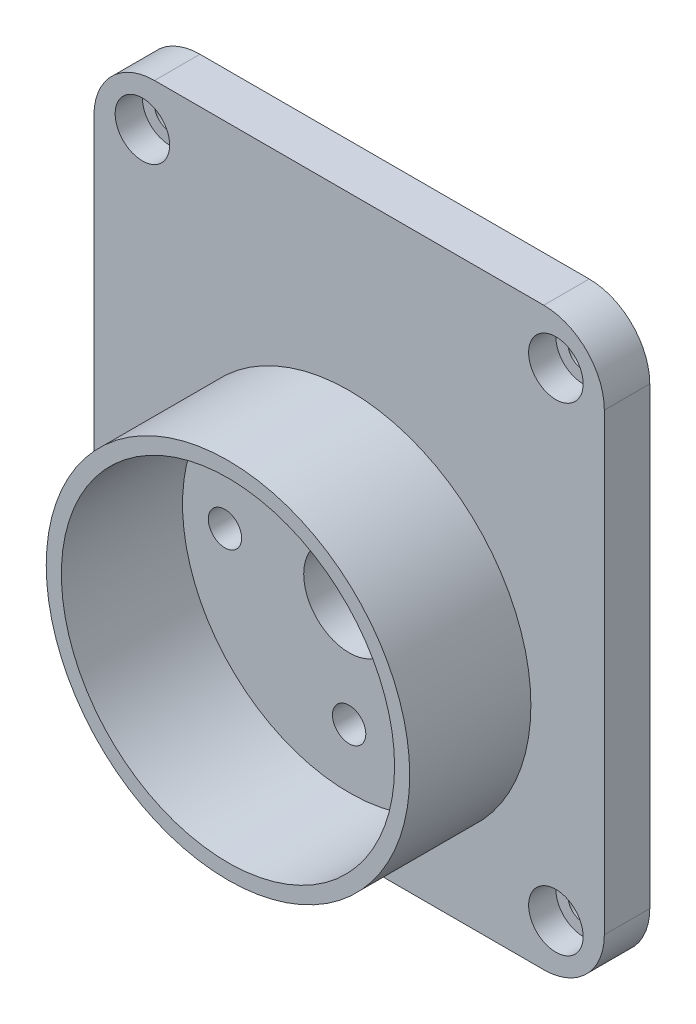
ISO-10303-21;
HEADER;
FILE_DESCRIPTION(('STEP AP214'),'2;1');
FILE_NAME('part.step','',(''),(''),'','','');
FILE_SCHEMA(('AUTOMOTIVE_DESIGN { 1 0 10303 214 1 1 1 1 }'));
ENDSEC;
DATA;
#1=APPLICATION_CONTEXT('core data for automotive mechanical design processes');
#2=APPLICATION_PROTOCOL_DEFINITION('international standard','automotive_design',2000,#1);
#3=PRODUCT_CONTEXT('',#1,'mechanical');
#4=PRODUCT('Part','Part','',(#3));
#5=PRODUCT_RELATED_PRODUCT_CATEGORY('part','',(#4));
#6=PRODUCT_DEFINITION_FORMATION('','',#4);
#7=PRODUCT_DEFINITION_CONTEXT('part definition',#1,'design');
#8=PRODUCT_DEFINITION('design','',#6,#7);
#9=PRODUCT_DEFINITION_SHAPE('','',#8);
#10=(LENGTH_UNIT() NAMED_UNIT(*) SI_UNIT(.MILLI.,.METRE.));
#11=(NAMED_UNIT(*) PLANE_ANGLE_UNIT() SI_UNIT($,.RADIAN.));
#12=(NAMED_UNIT(*) SI_UNIT($,.STERADIAN.) SOLID_ANGLE_UNIT());
#13=UNCERTAINTY_MEASURE_WITH_UNIT(LENGTH_MEASURE(1.E-05),#10,'distance_accuracy_value','');
#14=(GEOMETRIC_REPRESENTATION_CONTEXT(3) GLOBAL_UNCERTAINTY_ASSIGNED_CONTEXT((#13)) GLOBAL_UNIT_ASSIGNED_CONTEXT((#10,
#11,#12)) REPRESENTATION_CONTEXT('',''));
#15=CARTESIAN_POINT('',(0.,0.,0.));
#16=DIRECTION('',(0.,0.,1.));
#17=DIRECTION('',(1.,0.,0.));
#18=AXIS2_PLACEMENT_3D('',#15,#16,#17);
#19=CARTESIAN_POINT('',(-13.65,-11.5,3.));
#20=DIRECTION('',(0.,0.,-1.));
#21=DIRECTION('',(-1.,0.,0.));
#22=AXIS2_PLACEMENT_3D('',#19,#20,#21);
#23=CYLINDRICAL_SURFACE('',#22,1.);
#24=CARTESIAN_POINT('',(-13.65,-11.5,0.));
#25=DIRECTION('',(0.,0.,1.));
#26=DIRECTION('',(1.,0.,0.));
#27=AXIS2_PLACEMENT_3D('',#24,#25,#26);
#28=CIRCLE('',#27,1.);
#29=CARTESIAN_POINT('',(-12.65,-11.5,0.));
#30=VERTEX_POINT('',#29);
#31=EDGE_CURVE('E247',#30,#30,#28,.T.);
#32=ORIENTED_EDGE('',*,*,#31,.F.);
#33=EDGE_LOOP('',(#32));
#34=FACE_BOUND('',#33,.T.);
#35=CARTESIAN_POINT('',(-13.65,-11.5,1.2));
#36=DIRECTION('',(0.,0.,1.));
#37=DIRECTION('',(1.,0.,0.));
#38=AXIS2_PLACEMENT_3D('',#35,#36,#37);
#39=CIRCLE('',#38,1.);
#40=CARTESIAN_POINT('',(-12.65,-11.5,1.2));
#41=VERTEX_POINT('',#40);
#42=EDGE_CURVE('E313',#41,#41,#39,.T.);
#43=ORIENTED_EDGE('',*,*,#42,.T.);
#44=EDGE_LOOP('',(#43));
#45=FACE_BOUND('',#44,.T.);
#46=ADVANCED_FACE('F34',(#34,#45),#23,.F.);
#47=CARTESIAN_POINT('',(13.65,-11.5,3.));
#48=DIRECTION('',(0.,0.,-1.));
#49=DIRECTION('',(-1.,0.,0.));
#50=AXIS2_PLACEMENT_3D('',#47,#48,#49);
#51=CYLINDRICAL_SURFACE('',#50,0.999999999999999);
#52=CARTESIAN_POINT('',(13.65,-11.5,0.));
#53=DIRECTION('',(0.,0.,1.));
#54=DIRECTION('',(1.,0.,0.));
#55=AXIS2_PLACEMENT_3D('',#52,#53,#54);
#56=CIRCLE('',#55,0.999999999999999);
#57=CARTESIAN_POINT('',(14.65,-11.5,0.));
#58=VERTEX_POINT('',#57);
#59=EDGE_CURVE('E252',#58,#58,#56,.T.);
#60=ORIENTED_EDGE('',*,*,#59,.F.);
#61=EDGE_LOOP('',(#60));
#62=FACE_BOUND('',#61,.T.);
#63=CARTESIAN_POINT('',(13.65,-11.5,1.2));
#64=DIRECTION('',(0.,0.,1.));
#65=DIRECTION('',(1.,0.,0.));
#66=AXIS2_PLACEMENT_3D('',#63,#64,#65);
#67=CIRCLE('',#66,0.999999999999999);
#68=CARTESIAN_POINT('',(14.65,-11.5,1.2));
#69=VERTEX_POINT('',#68);
#70=EDGE_CURVE('E308',#69,#69,#67,.T.);
#71=ORIENTED_EDGE('',*,*,#70,.T.);
#72=EDGE_LOOP('',(#71));
#73=FACE_BOUND('',#72,.T.);
#74=ADVANCED_FACE('F390',(#62,#73),#51,.F.);
#75=CARTESIAN_POINT('',(13.65,20.1,3.));
#76=DIRECTION('',(0.,0.,-1.));
#77=DIRECTION('',(-1.,0.,0.));
#78=AXIS2_PLACEMENT_3D('',#75,#76,#77);
#79=CYLINDRICAL_SURFACE('',#78,1.);
#80=CARTESIAN_POINT('',(13.65,20.1,0.));
#81=DIRECTION('',(0.,0.,1.));
#82=DIRECTION('',(1.,0.,0.));
#83=AXIS2_PLACEMENT_3D('',#80,#81,#82);
#84=CIRCLE('',#83,1.);
#85=CARTESIAN_POINT('',(14.65,20.1,0.));
#86=VERTEX_POINT('',#85);
#87=EDGE_CURVE('E255',#86,#86,#84,.T.);
#88=ORIENTED_EDGE('',*,*,#87,.F.);
#89=EDGE_LOOP('',(#88));
#90=FACE_BOUND('',#89,.T.);
#91=CARTESIAN_POINT('',(13.65,20.1,1.2));
#92=DIRECTION('',(0.,0.,1.));
#93=DIRECTION('',(1.,0.,0.));
#94=AXIS2_PLACEMENT_3D('',#91,#92,#93);
#95=CIRCLE('',#94,1.);
#96=CARTESIAN_POINT('',(14.65,20.1,1.2));
#97=VERTEX_POINT('',#96);
#98=EDGE_CURVE('E304',#97,#97,#95,.T.);
#99=ORIENTED_EDGE('',*,*,#98,.T.);
#100=EDGE_LOOP('',(#99));
#101=FACE_BOUND('',#100,.T.);
#102=ADVANCED_FACE('F396',(#90,#101),#79,.F.);
#103=CARTESIAN_POINT('',(-13.65,20.1,3.));
#104=DIRECTION('',(0.,0.,-1.));
#105=DIRECTION('',(-1.,0.,0.));
#106=AXIS2_PLACEMENT_3D('',#103,#104,#105);
#107=CYLINDRICAL_SURFACE('',#106,1.);
#108=CARTESIAN_POINT('',(-13.65,20.1,0.));
#109=DIRECTION('',(0.,0.,1.));
#110=DIRECTION('',(1.,0.,0.));
#111=AXIS2_PLACEMENT_3D('',#108,#109,#110);
#112=CIRCLE('',#111,1.);
#113=CARTESIAN_POINT('',(-12.65,20.1,0.));
#114=VERTEX_POINT('',#113);
#115=EDGE_CURVE('E258',#114,#114,#112,.T.);
#116=ORIENTED_EDGE('',*,*,#115,.F.);
#117=EDGE_LOOP('',(#116));
#118=FACE_BOUND('',#117,.T.);
#119=CARTESIAN_POINT('',(-13.65,20.1,1.2));
#120=DIRECTION('',(0.,0.,1.));
#121=DIRECTION('',(1.,0.,0.));
#122=AXIS2_PLACEMENT_3D('',#119,#120,#121);
#123=CIRCLE('',#122,1.);
#124=CARTESIAN_POINT('',(-12.65,20.1,1.2));
#125=VERTEX_POINT('',#124);
#126=EDGE_CURVE('E211',#125,#125,#123,.T.);
#127=ORIENTED_EDGE('',*,*,#126,.T.);
#128=EDGE_LOOP('',(#127));
#129=FACE_BOUND('',#128,.T.);
#130=ADVANCED_FACE('F407',(#118,#129),#107,.F.);
#131=CARTESIAN_POINT('',(0.,0.,0.));
#132=DIRECTION('',(0.,0.,1.));
#133=DIRECTION('',(1.,0.,0.));
#134=AXIS2_PLACEMENT_3D('',#131,#132,#133);
#135=PLANE('',#134);
#136=ORIENTED_EDGE('',*,*,#31,.T.);
#137=EDGE_LOOP('',(#136));
#138=FACE_BOUND('',#137,.T.);
#139=ORIENTED_EDGE('',*,*,#59,.T.);
#140=EDGE_LOOP('',(#139));
#141=FACE_BOUND('',#140,.T.);
#142=ORIENTED_EDGE('',*,*,#87,.T.);
#143=EDGE_LOOP('',(#142));
#144=FACE_BOUND('',#143,.T.);
#145=ORIENTED_EDGE('',*,*,#115,.T.);
#146=EDGE_LOOP('',(#145));
#147=FACE_BOUND('',#146,.T.);
#148=DIRECTION('',(0.,-1.,0.));
#149=VECTOR('',#148,1.);
#150=CARTESIAN_POINT('',(-16.85,0.,0.));
#151=LINE('',#150,#149);
#152=CARTESIAN_POINT('',(-16.85,19.3,0.));
#153=VERTEX_POINT('',#152);
#154=CARTESIAN_POINT('',(-16.85,-10.7,0.));
#155=VERTEX_POINT('',#154);
#156=EDGE_CURVE('E276',#153,#155,#151,.T.);
#157=ORIENTED_EDGE('',*,*,#156,.F.);
#158=CARTESIAN_POINT('',(-12.85,19.3,0.));
#159=DIRECTION('',(0.,0.,1.));
#160=DIRECTION('',(1.,0.,0.));
#161=AXIS2_PLACEMENT_3D('',#158,#159,#160);
#162=CIRCLE('',#161,4.);
#163=CARTESIAN_POINT('',(-12.85,23.3,0.));
#164=VERTEX_POINT('',#163);
#165=EDGE_CURVE('E328',#153,#164,#162,.F.);
#166=ORIENTED_EDGE('',*,*,#165,.T.);
#167=DIRECTION('',(-1.,0.,0.));
#168=VECTOR('',#167,1.);
#169=CARTESIAN_POINT('',(16.85,23.3,0.));
#170=LINE('',#169,#168);
#171=CARTESIAN_POINT('',(12.85,23.3,0.));
#172=VERTEX_POINT('',#171);
#173=EDGE_CURVE('E281',#172,#164,#170,.T.);
#174=ORIENTED_EDGE('',*,*,#173,.F.);
#175=CARTESIAN_POINT('',(12.85,19.3,0.));
#176=DIRECTION('',(0.,0.,1.));
#177=DIRECTION('',(1.,0.,0.));
#178=AXIS2_PLACEMENT_3D('',#175,#176,#177);
#179=CIRCLE('',#178,4.);
#180=CARTESIAN_POINT('',(16.85,19.3,0.));
#181=VERTEX_POINT('',#180);
#182=EDGE_CURVE('E322',#172,#181,#179,.F.);
#183=ORIENTED_EDGE('',*,*,#182,.T.);
#184=DIRECTION('',(0.,1.,0.));
#185=VECTOR('',#184,1.);
#186=CARTESIAN_POINT('',(16.85,-14.7,0.));
#187=LINE('',#186,#185);
#188=CARTESIAN_POINT('',(16.85,-10.7,0.));
#189=VERTEX_POINT('',#188);
#190=EDGE_CURVE('E294',#189,#181,#187,.T.);
#191=ORIENTED_EDGE('',*,*,#190,.F.);
#192=CARTESIAN_POINT('',(12.85,-10.7,0.));
#193=DIRECTION('',(0.,0.,1.));
#194=DIRECTION('',(1.,0.,0.));
#195=AXIS2_PLACEMENT_3D('',#192,#193,#194);
#196=CIRCLE('',#195,4.);
#197=CARTESIAN_POINT('',(12.85,-14.7,0.));
#198=VERTEX_POINT('',#197);
#199=EDGE_CURVE('E324',#189,#198,#196,.F.);
#200=ORIENTED_EDGE('',*,*,#199,.T.);
#201=DIRECTION('',(1.,0.,0.));
#202=VECTOR('',#201,1.);
#203=CARTESIAN_POINT('',(0.,-14.7,0.));
#204=LINE('',#203,#202);
#205=CARTESIAN_POINT('',(-12.85,-14.7,0.));
#206=VERTEX_POINT('',#205);
#207=EDGE_CURVE('E291',#206,#198,#204,.T.);
#208=ORIENTED_EDGE('',*,*,#207,.F.);
#209=CARTESIAN_POINT('',(-12.85,-10.7,0.));
#210=DIRECTION('',(0.,0.,1.));
#211=DIRECTION('',(1.,0.,0.));
#212=AXIS2_PLACEMENT_3D('',#209,#210,#211);
#213=CIRCLE('',#212,4.);
#214=EDGE_CURVE('E326',#206,#155,#213,.F.);
#215=ORIENTED_EDGE('',*,*,#214,.T.);
#216=EDGE_LOOP('',(#157,#166,#174,#183,#191,#200,#208,#215));
#217=FACE_BOUND('',#216,.T.);
#218=CARTESIAN_POINT('',(-13.65,-11.5,0.));
#219=DIRECTION('',(0.,0.,-1.));
#220=DIRECTION('',(-1.,0.,0.));
#221=AXIS2_PLACEMENT_3D('',#218,#219,#220);
#222=CIRCLE('',#221,3.20000000000001);
#223=CARTESIAN_POINT('',(-15.85,-9.17620999227555,0.));
#224=VERTEX_POINT('',#223);
#225=CARTESIAN_POINT('',(-11.3262099922755,-13.7,0.));
#226=VERTEX_POINT('',#225);
#227=EDGE_CURVE('E166',#224,#226,#222,.T.);
#228=ORIENTED_EDGE('',*,*,#227,.T.);
#229=DIRECTION('',(-1.,0.,0.));
#230=VECTOR('',#229,1.);
#231=CARTESIAN_POINT('',(0.,-13.7,0.));
#232=LINE('',#231,#230);
#233=CARTESIAN_POINT('',(11.3262099922756,-13.7,0.));
#234=VERTEX_POINT('',#233);
#235=EDGE_CURVE('E175',#234,#226,#232,.T.);
#236=ORIENTED_EDGE('',*,*,#235,.F.);
#237=CARTESIAN_POINT('',(13.65,-11.5,0.));
#238=DIRECTION('',(0.,0.,-1.));
#239=DIRECTION('',(-1.,0.,0.));
#240=AXIS2_PLACEMENT_3D('',#237,#238,#239);
#241=CIRCLE('',#240,3.19999999999999);
#242=CARTESIAN_POINT('',(15.85,-9.17620999227554,0.));
#243=VERTEX_POINT('',#242);
#244=EDGE_CURVE('E178',#234,#243,#241,.T.);
#245=ORIENTED_EDGE('',*,*,#244,.T.);
#246=DIRECTION('',(0.,-1.,0.));
#247=VECTOR('',#246,1.);
#248=CARTESIAN_POINT('',(15.85,0.,0.));
#249=LINE('',#248,#247);
#250=CARTESIAN_POINT('',(15.85,17.7762099922755,0.));
#251=VERTEX_POINT('',#250);
#252=EDGE_CURVE('E222',#251,#243,#249,.T.);
#253=ORIENTED_EDGE('',*,*,#252,.F.);
#254=CARTESIAN_POINT('',(13.65,20.1,0.));
#255=DIRECTION('',(0.,0.,-1.));
#256=DIRECTION('',(-1.,0.,0.));
#257=AXIS2_PLACEMENT_3D('',#254,#255,#256);
#258=CIRCLE('',#257,3.2);
#259=CARTESIAN_POINT('',(11.3262099922756,22.3,0.));
#260=VERTEX_POINT('',#259);
#261=EDGE_CURVE('E219',#251,#260,#258,.T.);
#262=ORIENTED_EDGE('',*,*,#261,.T.);
#263=DIRECTION('',(-1.,0.,0.));
#264=VECTOR('',#263,1.);
#265=CARTESIAN_POINT('',(0.,22.3,0.));
#266=LINE('',#265,#264);
#267=CARTESIAN_POINT('',(-11.3262099922755,22.3,0.));
#268=VERTEX_POINT('',#267);
#269=EDGE_CURVE('E216',#260,#268,#266,.T.);
#270=ORIENTED_EDGE('',*,*,#269,.T.);
#271=CARTESIAN_POINT('',(-13.65,20.1,0.));
#272=DIRECTION('',(0.,0.,-1.));
#273=DIRECTION('',(-1.,0.,0.));
#274=AXIS2_PLACEMENT_3D('',#271,#272,#273);
#275=CIRCLE('',#274,3.20000000000001);
#276=CARTESIAN_POINT('',(-15.85,17.7762099922755,0.));
#277=VERTEX_POINT('',#276);
#278=EDGE_CURVE('E213',#268,#277,#275,.T.);
#279=ORIENTED_EDGE('',*,*,#278,.T.);
#280=DIRECTION('',(0.,-1.,0.));
#281=VECTOR('',#280,1.);
#282=CARTESIAN_POINT('',(-15.85,0.,0.));
#283=LINE('',#282,#281);
#284=EDGE_CURVE('E210',#277,#224,#283,.T.);
#285=ORIENTED_EDGE('',*,*,#284,.T.);
#286=EDGE_LOOP('',(#228,#236,#245,#253,#262,#270,#279,#285));
#287=FACE_BOUND('',#286,.T.);
#288=ADVANCED_FACE('F356',(#138,#141,#144,#147,#217,#287),#135,.F.);
#289=CARTESIAN_POINT('',(0.,0.,3.));
#290=DIRECTION('',(0.,0.,-1.));
#291=DIRECTION('',(-1.,0.,0.));
#292=AXIS2_PLACEMENT_3D('',#289,#290,#291);
#293=CYLINDRICAL_SURFACE('',#292,3.);
#294=CARTESIAN_POINT('',(0.,0.,3.));
#295=DIRECTION('',(0.,0.,1.));
#296=DIRECTION('',(1.,0.,0.));
#297=AXIS2_PLACEMENT_3D('',#294,#295,#296);
#298=CIRCLE('',#297,3.);
#299=CARTESIAN_POINT('',(3.,0.,3.));
#300=VERTEX_POINT('',#299);
#301=EDGE_CURVE('E273',#300,#300,#298,.T.);
#302=ORIENTED_EDGE('',*,*,#301,.T.);
#303=EDGE_LOOP('',(#302));
#304=FACE_BOUND('',#303,.T.);
#305=CARTESIAN_POINT('',(0.,0.,1.));
#306=DIRECTION('',(0.,0.,-1.));
#307=DIRECTION('',(-1.,0.,0.));
#308=AXIS2_PLACEMENT_3D('',#305,#306,#307);
#309=CIRCLE('',#308,3.);
#310=CARTESIAN_POINT('',(-3.,0.,1.));
#311=VERTEX_POINT('',#310);
#312=EDGE_CURVE('E195',#311,#311,#309,.F.);
#313=ORIENTED_EDGE('',*,*,#312,.F.);
#314=EDGE_LOOP('',(#313));
#315=FACE_BOUND('',#314,.T.);
#316=ADVANCED_FACE('F428',(#304,#315),#293,.F.);
#317=CARTESIAN_POINT('',(-8.2,0.,3.));
#318=DIRECTION('',(0.,0.,-1.));
#319=DIRECTION('',(-1.,0.,0.));
#320=AXIS2_PLACEMENT_3D('',#317,#318,#319);
#321=CYLINDRICAL_SURFACE('',#320,1.1);
#322=CARTESIAN_POINT('',(-8.2,0.,3.));
#323=DIRECTION('',(0.,0.,1.));
#324=DIRECTION('',(1.,0.,0.));
#325=AXIS2_PLACEMENT_3D('',#322,#323,#324);
#326=CIRCLE('',#325,1.1);
#327=CARTESIAN_POINT('',(-7.1,0.,3.));
#328=VERTEX_POINT('',#327);
#329=EDGE_CURVE('E270',#328,#328,#326,.T.);
#330=ORIENTED_EDGE('',*,*,#329,.T.);
#331=EDGE_LOOP('',(#330));
#332=FACE_BOUND('',#331,.T.);
#333=CARTESIAN_POINT('',(-8.2,0.,1.));
#334=DIRECTION('',(0.,0.,-1.));
#335=DIRECTION('',(-1.,0.,0.));
#336=AXIS2_PLACEMENT_3D('',#333,#334,#335);
#337=CIRCLE('',#336,1.1);
#338=CARTESIAN_POINT('',(-9.3,0.,1.));
#339=VERTEX_POINT('',#338);
#340=EDGE_CURVE('E167',#339,#339,#337,.F.);
#341=ORIENTED_EDGE('',*,*,#340,.F.);
#342=EDGE_LOOP('',(#341));
#343=FACE_BOUND('',#342,.T.);
#344=ADVANCED_FACE('F424',(#332,#343),#321,.F.);
#345=CARTESIAN_POINT('',(8.2,0.,3.));
#346=DIRECTION('',(0.,0.,-1.));
#347=DIRECTION('',(-1.,0.,0.));
#348=AXIS2_PLACEMENT_3D('',#345,#346,#347);
#349=CYLINDRICAL_SURFACE('',#348,1.1);
#350=CARTESIAN_POINT('',(8.2,0.,3.));
#351=DIRECTION('',(0.,0.,1.));
#352=DIRECTION('',(1.,0.,0.));
#353=AXIS2_PLACEMENT_3D('',#350,#351,#352);
#354=CIRCLE('',#353,1.1);
#355=CARTESIAN_POINT('',(9.3,0.,3.));
#356=VERTEX_POINT('',#355);
#357=EDGE_CURVE('E267',#356,#356,#354,.T.);
#358=ORIENTED_EDGE('',*,*,#357,.T.);
#359=EDGE_LOOP('',(#358));
#360=FACE_BOUND('',#359,.T.);
#361=CARTESIAN_POINT('',(8.2,0.,1.));
#362=DIRECTION('',(0.,0.,-1.));
#363=DIRECTION('',(-1.,0.,0.));
#364=AXIS2_PLACEMENT_3D('',#361,#362,#363);
#365=CIRCLE('',#364,1.1);
#366=CARTESIAN_POINT('',(7.1,0.,1.));
#367=VERTEX_POINT('',#366);
#368=EDGE_CURVE('E198',#367,#367,#365,.F.);
#369=ORIENTED_EDGE('',*,*,#368,.F.);
#370=EDGE_LOOP('',(#369));
#371=FACE_BOUND('',#370,.T.);
#372=ADVANCED_FACE('F420',(#360,#371),#349,.F.);
#373=CARTESIAN_POINT('',(0.,7.1,3.));
#374=DIRECTION('',(0.,0.,-1.));
#375=DIRECTION('',(-1.,0.,0.));
#376=AXIS2_PLACEMENT_3D('',#373,#374,#375);
#377=CYLINDRICAL_SURFACE('',#376,1.1);
#378=CARTESIAN_POINT('',(0.,7.1,3.));
#379=DIRECTION('',(0.,0.,1.));
#380=DIRECTION('',(1.,0.,0.));
#381=AXIS2_PLACEMENT_3D('',#378,#379,#380);
#382=CIRCLE('',#381,1.1);
#383=CARTESIAN_POINT('',(1.1,7.1,3.));
#384=VERTEX_POINT('',#383);
#385=EDGE_CURVE('E264',#384,#384,#382,.T.);
#386=ORIENTED_EDGE('',*,*,#385,.T.);
#387=EDGE_LOOP('',(#386));
#388=FACE_BOUND('',#387,.T.);
#389=CARTESIAN_POINT('',(0.,7.1,1.));
#390=DIRECTION('',(0.,0.,-1.));
#391=DIRECTION('',(-1.,0.,0.));
#392=AXIS2_PLACEMENT_3D('',#389,#390,#391);
#393=CIRCLE('',#392,1.1);
#394=CARTESIAN_POINT('',(-1.1,7.1,1.));
#395=VERTEX_POINT('',#394);
#396=EDGE_CURVE('E204',#395,#395,#393,.F.);
#397=ORIENTED_EDGE('',*,*,#396,.F.);
#398=EDGE_LOOP('',(#397));
#399=FACE_BOUND('',#398,.T.);
#400=ADVANCED_FACE('F416',(#388,#399),#377,.F.);
#401=CARTESIAN_POINT('',(0.,-7.1,3.));
#402=DIRECTION('',(0.,0.,-1.));
#403=DIRECTION('',(-1.,0.,0.));
#404=AXIS2_PLACEMENT_3D('',#401,#402,#403);
#405=CYLINDRICAL_SURFACE('',#404,1.1);
#406=CARTESIAN_POINT('',(0.,-7.1,3.));
#407=DIRECTION('',(0.,0.,1.));
#408=DIRECTION('',(1.,0.,0.));
#409=AXIS2_PLACEMENT_3D('',#406,#407,#408);
#410=CIRCLE('',#409,1.1);
#411=CARTESIAN_POINT('',(1.1,-7.1,3.));
#412=VERTEX_POINT('',#411);
#413=EDGE_CURVE('E261',#412,#412,#410,.T.);
#414=ORIENTED_EDGE('',*,*,#413,.T.);
#415=EDGE_LOOP('',(#414));
#416=FACE_BOUND('',#415,.T.);
#417=CARTESIAN_POINT('',(0.,-7.1,1.));
#418=DIRECTION('',(0.,0.,-1.));
#419=DIRECTION('',(-1.,0.,0.));
#420=AXIS2_PLACEMENT_3D('',#417,#418,#419);
#421=CIRCLE('',#420,1.1);
#422=CARTESIAN_POINT('',(-1.1,-7.1,1.));
#423=VERTEX_POINT('',#422);
#424=EDGE_CURVE('E201',#423,#423,#421,.F.);
#425=ORIENTED_EDGE('',*,*,#424,.F.);
#426=EDGE_LOOP('',(#425));
#427=FACE_BOUND('',#426,.T.);
#428=ADVANCED_FACE('F412',(#416,#427),#405,.F.);
#429=CARTESIAN_POINT('',(0.,0.,3.));
#430=DIRECTION('',(0.,0.,1.));
#431=DIRECTION('',(1.,0.,0.));
#432=AXIS2_PLACEMENT_3D('',#429,#430,#431);
#433=PLANE('',#432);
#434=ORIENTED_EDGE('',*,*,#413,.F.);
#435=EDGE_LOOP('',(#434));
#436=FACE_BOUND('',#435,.T.);
#437=ORIENTED_EDGE('',*,*,#357,.F.);
#438=EDGE_LOOP('',(#437));
#439=FACE_BOUND('',#438,.T.);
#440=ORIENTED_EDGE('',*,*,#301,.F.);
#441=EDGE_LOOP('',(#440));
#442=FACE_BOUND('',#441,.T.);
#443=ORIENTED_EDGE('',*,*,#329,.F.);
#444=EDGE_LOOP('',(#443));
#445=FACE_BOUND('',#444,.T.);
#446=ORIENTED_EDGE('',*,*,#385,.F.);
#447=EDGE_LOOP('',(#446));
#448=FACE_BOUND('',#447,.T.);
#449=CARTESIAN_POINT('',(0.,0.,3.));
#450=DIRECTION('',(0.,0.,1.));
#451=DIRECTION('',(1.,0.,0.));
#452=AXIS2_PLACEMENT_3D('',#449,#450,#451);
#453=CIRCLE('',#452,11.);
#454=CARTESIAN_POINT('',(11.,0.,3.));
#455=VERTEX_POINT('',#454);
#456=EDGE_CURVE('E288',#455,#455,#453,.F.);
#457=ORIENTED_EDGE('',*,*,#456,.F.);
#458=EDGE_LOOP('',(#457));
#459=FACE_BOUND('',#458,.T.);
#460=ADVANCED_FACE('F415',(#436,#439,#442,#445,#448,#459),#433,.T.);
#461=CARTESIAN_POINT('',(-13.65,-11.5,3.));
#462=DIRECTION('',(0.,0.,1.));
#463=DIRECTION('',(1.,0.,0.));
#464=AXIS2_PLACEMENT_3D('',#461,#462,#463);
#465=CIRCLE('',#464,1.8);
#466=CARTESIAN_POINT('',(-11.85,-11.5,3.));
#467=VERTEX_POINT('',#466);
#468=EDGE_CURVE('E791',#467,#467,#465,.T.);
#469=ORIENTED_EDGE('',*,*,#468,.F.);
#470=EDGE_LOOP('',(#469));
#471=FACE_BOUND('',#470,.T.);
#472=CARTESIAN_POINT('',(13.65,-11.5,3.));
#473=DIRECTION('',(0.,0.,1.));
#474=DIRECTION('',(1.,0.,0.));
#475=AXIS2_PLACEMENT_3D('',#472,#473,#474);
#476=CIRCLE('',#475,1.8);
#477=CARTESIAN_POINT('',(15.45,-11.5,3.));
#478=VERTEX_POINT('',#477);
#479=EDGE_CURVE('E316',#478,#478,#476,.T.);
#480=ORIENTED_EDGE('',*,*,#479,.F.);
#481=EDGE_LOOP('',(#480));
#482=FACE_BOUND('',#481,.T.);
#483=CARTESIAN_POINT('',(13.65,20.1,3.));
#484=DIRECTION('',(0.,0.,1.));
#485=DIRECTION('',(1.,0.,0.));
#486=AXIS2_PLACEMENT_3D('',#483,#484,#485);
#487=CIRCLE('',#486,1.8);
#488=CARTESIAN_POINT('',(15.45,20.1,3.));
#489=VERTEX_POINT('',#488);
#490=EDGE_CURVE('E311',#489,#489,#487,.T.);
#491=ORIENTED_EDGE('',*,*,#490,.F.);
#492=EDGE_LOOP('',(#491));
#493=FACE_BOUND('',#492,.T.);
#494=CARTESIAN_POINT('',(-13.65,20.1,3.));
#495=DIRECTION('',(0.,0.,1.));
#496=DIRECTION('',(1.,0.,0.));
#497=AXIS2_PLACEMENT_3D('',#494,#495,#496);
#498=CIRCLE('',#497,1.8);
#499=CARTESIAN_POINT('',(-11.85,20.1,3.));
#500=VERTEX_POINT('',#499);
#501=EDGE_CURVE('E181',#500,#500,#498,.T.);
#502=ORIENTED_EDGE('',*,*,#501,.F.);
#503=EDGE_LOOP('',(#502));
#504=FACE_BOUND('',#503,.T.);
#505=CARTESIAN_POINT('',(0.,0.,3.));
#506=DIRECTION('',(0.,0.,1.));
#507=DIRECTION('',(1.,0.,0.));
#508=AXIS2_PLACEMENT_3D('',#505,#506,#507);
#509=CIRCLE('',#508,12.);
#510=CARTESIAN_POINT('',(12.,0.,3.));
#511=VERTEX_POINT('',#510);
#512=EDGE_CURVE('E243',#511,#511,#509,.T.);
#513=ORIENTED_EDGE('',*,*,#512,.F.);
#514=EDGE_LOOP('',(#513));
#515=FACE_BOUND('',#514,.T.);
#516=DIRECTION('',(-1.,0.,0.));
#517=VECTOR('',#516,1.);
#518=CARTESIAN_POINT('',(16.85,23.3,3.));
#519=LINE('',#518,#517);
#520=CARTESIAN_POINT('',(12.85,23.3,3.));
#521=VERTEX_POINT('',#520);
#522=CARTESIAN_POINT('',(-12.85,23.3,3.));
#523=VERTEX_POINT('',#522);
#524=EDGE_CURVE('E285',#521,#523,#519,.T.);
#525=ORIENTED_EDGE('',*,*,#524,.T.);
#526=CARTESIAN_POINT('',(-12.85,19.3,3.));
#527=DIRECTION('',(0.,0.,1.));
#528=DIRECTION('',(1.,0.,0.));
#529=AXIS2_PLACEMENT_3D('',#526,#527,#528);
#530=CIRCLE('',#529,4.);
#531=CARTESIAN_POINT('',(-16.85,19.3,3.));
#532=VERTEX_POINT('',#531);
#533=EDGE_CURVE('E340',#523,#532,#530,.T.);
#534=ORIENTED_EDGE('',*,*,#533,.T.);
#535=DIRECTION('',(0.,-1.,0.));
#536=VECTOR('',#535,1.);
#537=CARTESIAN_POINT('',(-16.85,23.3,3.));
#538=LINE('',#537,#536);
#539=CARTESIAN_POINT('',(-16.85,-10.7,3.));
#540=VERTEX_POINT('',#539);
#541=EDGE_CURVE('E277',#532,#540,#538,.T.);
#542=ORIENTED_EDGE('',*,*,#541,.T.);
#543=CARTESIAN_POINT('',(-12.85,-10.7,3.));
#544=DIRECTION('',(0.,0.,1.));
#545=DIRECTION('',(1.,0.,0.));
#546=AXIS2_PLACEMENT_3D('',#543,#544,#545);
#547=CIRCLE('',#546,4.);
#548=CARTESIAN_POINT('',(-12.85,-14.7,3.));
#549=VERTEX_POINT('',#548);
#550=EDGE_CURVE('E338',#540,#549,#547,.T.);
#551=ORIENTED_EDGE('',*,*,#550,.T.);
#552=DIRECTION('',(1.,0.,0.));
#553=VECTOR('',#552,1.);
#554=CARTESIAN_POINT('',(-16.85,-14.7,3.));
#555=LINE('',#554,#553);
#556=CARTESIAN_POINT('',(12.85,-14.7,3.));
#557=VERTEX_POINT('',#556);
#558=EDGE_CURVE('E280',#549,#557,#555,.T.);
#559=ORIENTED_EDGE('',*,*,#558,.T.);
#560=CARTESIAN_POINT('',(12.85,-10.7,3.));
#561=DIRECTION('',(0.,0.,1.));
#562=DIRECTION('',(1.,0.,0.));
#563=AXIS2_PLACEMENT_3D('',#560,#561,#562);
#564=CIRCLE('',#563,4.);
#565=CARTESIAN_POINT('',(16.85,-10.7,3.));
#566=VERTEX_POINT('',#565);
#567=EDGE_CURVE('E55',#557,#566,#564,.T.);
#568=ORIENTED_EDGE('',*,*,#567,.T.);
#569=DIRECTION('',(0.,1.,0.));
#570=VECTOR('',#569,1.);
#571=CARTESIAN_POINT('',(16.85,-14.7,3.));
#572=LINE('',#571,#570);
#573=CARTESIAN_POINT('',(16.85,19.3,3.));
#574=VERTEX_POINT('',#573);
#575=EDGE_CURVE('E283',#566,#574,#572,.T.);
#576=ORIENTED_EDGE('',*,*,#575,.T.);
#577=CARTESIAN_POINT('',(12.85,19.3,3.));
#578=DIRECTION('',(0.,0.,1.));
#579=DIRECTION('',(1.,0.,0.));
#580=AXIS2_PLACEMENT_3D('',#577,#578,#579);
#581=CIRCLE('',#580,4.);
#582=EDGE_CURVE('E335',#574,#521,#581,.T.);
#583=ORIENTED_EDGE('',*,*,#582,.T.);
#584=EDGE_LOOP('',(#525,#534,#542,#551,#559,#568,#576,#583));
#585=FACE_BOUND('',#584,.T.);
#586=ADVANCED_FACE('F364',(#471,#482,#493,#504,#515,#585),#433,.T.);
#587=CARTESIAN_POINT('',(-16.85,0.,3.));
#588=DIRECTION('',(1.,0.,0.));
#589=DIRECTION('',(0.,1.,0.));
#590=AXIS2_PLACEMENT_3D('',#587,#588,#589);
#591=PLANE('',#590);
#592=ORIENTED_EDGE('',*,*,#541,.F.);
#593=DIRECTION('',(0.,0.,-1.));
#594=VECTOR('',#593,1.);
#595=CARTESIAN_POINT('',(-16.85,19.3,3.));
#596=LINE('',#595,#594);
#597=EDGE_CURVE('E319',#532,#153,#596,.T.);
#598=ORIENTED_EDGE('',*,*,#597,.T.);
#599=ORIENTED_EDGE('',*,*,#156,.T.);
#600=DIRECTION('',(0.,0.,-1.));
#601=VECTOR('',#600,1.);
#602=CARTESIAN_POINT('',(-16.85,-10.7,3.));
#603=LINE('',#602,#601);
#604=EDGE_CURVE('E300',#155,#540,#603,.F.);
#605=ORIENTED_EDGE('',*,*,#604,.T.);
#606=EDGE_LOOP('',(#592,#598,#599,#605));
#607=FACE_BOUND('',#606,.T.);
#608=ADVANCED_FACE('F378',(#607),#591,.F.);
#609=CARTESIAN_POINT('',(0.,-14.7,3.));
#610=DIRECTION('',(0.,1.,0.));
#611=DIRECTION('',(-1.,0.,0.));
#612=AXIS2_PLACEMENT_3D('',#609,#610,#611);
#613=PLANE('',#612);
#614=ORIENTED_EDGE('',*,*,#558,.F.);
#615=DIRECTION('',(0.,0.,-1.));
#616=VECTOR('',#615,1.);
#617=CARTESIAN_POINT('',(-12.85,-14.7,3.));
#618=LINE('',#617,#616);
#619=EDGE_CURVE('E344',#549,#206,#618,.T.);
#620=ORIENTED_EDGE('',*,*,#619,.T.);
#621=ORIENTED_EDGE('',*,*,#207,.T.);
#622=DIRECTION('',(0.,0.,-1.));
#623=VECTOR('',#622,1.);
#624=CARTESIAN_POINT('',(12.85,-14.7,3.));
#625=LINE('',#624,#623);
#626=EDGE_CURVE('E342',#198,#557,#625,.F.);
#627=ORIENTED_EDGE('',*,*,#626,.T.);
#628=EDGE_LOOP('',(#614,#620,#621,#627));
#629=FACE_BOUND('',#628,.T.);
#630=ADVANCED_FACE('F350',(#629),#613,.F.);
#631=CARTESIAN_POINT('',(16.85,-14.7,3.));
#632=DIRECTION('',(-1.,0.,0.));
#633=DIRECTION('',(0.,-1.,0.));
#634=AXIS2_PLACEMENT_3D('',#631,#632,#633);
#635=PLANE('',#634);
#636=ORIENTED_EDGE('',*,*,#575,.F.);
#637=DIRECTION('',(0.,0.,-1.));
#638=VECTOR('',#637,1.);
#639=CARTESIAN_POINT('',(16.85,-10.7,3.));
#640=LINE('',#639,#638);
#641=EDGE_CURVE('E11',#566,#189,#640,.T.);
#642=ORIENTED_EDGE('',*,*,#641,.T.);
#643=ORIENTED_EDGE('',*,*,#190,.T.);
#644=DIRECTION('',(0.,0.,-1.));
#645=VECTOR('',#644,1.);
#646=CARTESIAN_POINT('',(16.85,19.3,3.));
#647=LINE('',#646,#645);
#648=EDGE_CURVE('E42',#181,#574,#647,.F.);
#649=ORIENTED_EDGE('',*,*,#648,.T.);
#650=EDGE_LOOP('',(#636,#642,#643,#649));
#651=FACE_BOUND('',#650,.T.);
#652=ADVANCED_FACE('F362',(#651),#635,.F.);
#653=CARTESIAN_POINT('',(16.85,23.3,3.));
#654=DIRECTION('',(0.,-1.,0.));
#655=DIRECTION('',(1.,0.,0.));
#656=AXIS2_PLACEMENT_3D('',#653,#654,#655);
#657=PLANE('',#656);
#658=ORIENTED_EDGE('',*,*,#173,.T.);
#659=DIRECTION('',(0.,0.,-1.));
#660=VECTOR('',#659,1.);
#661=CARTESIAN_POINT('',(-12.85,23.3,3.));
#662=LINE('',#661,#660);
#663=EDGE_CURVE('E333',#164,#523,#662,.F.);
#664=ORIENTED_EDGE('',*,*,#663,.T.);
#665=ORIENTED_EDGE('',*,*,#524,.F.);
#666=DIRECTION('',(0.,0.,-1.));
#667=VECTOR('',#666,1.);
#668=CARTESIAN_POINT('',(12.85,23.3,3.));
#669=LINE('',#668,#667);
#670=EDGE_CURVE('E330',#521,#172,#669,.T.);
#671=ORIENTED_EDGE('',*,*,#670,.T.);
#672=EDGE_LOOP('',(#658,#664,#665,#671));
#673=FACE_BOUND('',#672,.T.);
#674=ADVANCED_FACE('F370',(#673),#657,.F.);
#675=CARTESIAN_POINT('',(0.,0.,11.));
#676=DIRECTION('',(0.,0.,1.));
#677=DIRECTION('',(1.,0.,0.));
#678=AXIS2_PLACEMENT_3D('',#675,#676,#677);
#679=PLANE('',#678);
#680=CARTESIAN_POINT('',(0.,0.,11.));
#681=DIRECTION('',(0.,0.,1.));
#682=DIRECTION('',(1.,0.,0.));
#683=AXIS2_PLACEMENT_3D('',#680,#681,#682);
#684=CIRCLE('',#683,12.);
#685=CARTESIAN_POINT('',(12.,0.,11.));
#686=VERTEX_POINT('',#685);
#687=EDGE_CURVE('E244',#686,#686,#684,.T.);
#688=ORIENTED_EDGE('',*,*,#687,.T.);
#689=EDGE_LOOP('',(#688));
#690=FACE_BOUND('',#689,.T.);
#691=CARTESIAN_POINT('',(0.,0.,11.));
#692=DIRECTION('',(0.,0.,1.));
#693=DIRECTION('',(1.,0.,0.));
#694=AXIS2_PLACEMENT_3D('',#691,#692,#693);
#695=CIRCLE('',#694,11.);
#696=CARTESIAN_POINT('',(11.,0.,11.));
#697=VERTEX_POINT('',#696);
#698=EDGE_CURVE('E229',#697,#697,#695,.T.);
#699=ORIENTED_EDGE('',*,*,#698,.F.);
#700=EDGE_LOOP('',(#699));
#701=FACE_BOUND('',#700,.T.);
#702=ADVANCED_FACE('F441',(#690,#701),#679,.T.);
#703=CARTESIAN_POINT('',(0.,0.,11.));
#704=DIRECTION('',(0.,0.,-1.));
#705=DIRECTION('',(-1.,0.,0.));
#706=AXIS2_PLACEMENT_3D('',#703,#704,#705);
#707=CYLINDRICAL_SURFACE('',#706,12.);
#708=ORIENTED_EDGE('',*,*,#687,.F.);
#709=EDGE_LOOP('',(#708));
#710=FACE_BOUND('',#709,.T.);
#711=ORIENTED_EDGE('',*,*,#512,.T.);
#712=EDGE_LOOP('',(#711));
#713=FACE_BOUND('',#712,.T.);
#714=ADVANCED_FACE('F402',(#710,#713),#707,.T.);
#715=CARTESIAN_POINT('',(0.,0.,11.));
#716=DIRECTION('',(0.,0.,-1.));
#717=DIRECTION('',(-1.,0.,0.));
#718=AXIS2_PLACEMENT_3D('',#715,#716,#717);
#719=CYLINDRICAL_SURFACE('',#718,11.);
#720=ORIENTED_EDGE('',*,*,#698,.T.);
#721=EDGE_LOOP('',(#720));
#722=FACE_BOUND('',#721,.T.);
#723=ORIENTED_EDGE('',*,*,#456,.T.);
#724=EDGE_LOOP('',(#723));
#725=FACE_BOUND('',#724,.T.);
#726=ADVANCED_FACE('F478',(#722,#725),#719,.F.);
#727=CARTESIAN_POINT('',(-13.65,-11.5,1.));
#728=DIRECTION('',(0.,0.,-1.));
#729=DIRECTION('',(-1.,0.,0.));
#730=AXIS2_PLACEMENT_3D('',#727,#728,#729);
#731=CYLINDRICAL_SURFACE('',#730,3.20000000000001);
#732=ORIENTED_EDGE('',*,*,#227,.F.);
#733=DIRECTION('',(0.,0.,-1.));
#734=VECTOR('',#733,1.);
#735=CARTESIAN_POINT('',(-15.85,-9.17620999227555,1.));
#736=LINE('',#735,#734);
#737=CARTESIAN_POINT('',(-15.85,-9.17620999227555,1.));
#738=VERTEX_POINT('',#737);
#739=EDGE_CURVE('E153',#738,#224,#736,.T.);
#740=ORIENTED_EDGE('',*,*,#739,.F.);
#741=CARTESIAN_POINT('',(-13.65,-11.5,1.));
#742=DIRECTION('',(0.,0.,-1.));
#743=DIRECTION('',(-1.,0.,0.));
#744=AXIS2_PLACEMENT_3D('',#741,#742,#743);
#745=CIRCLE('',#744,3.20000000000001);
#746=CARTESIAN_POINT('',(-11.3262099922755,-13.7,1.));
#747=VERTEX_POINT('',#746);
#748=EDGE_CURVE('E160',#738,#747,#745,.T.);
#749=ORIENTED_EDGE('',*,*,#748,.T.);
#750=DIRECTION('',(0.,0.,-1.));
#751=VECTOR('',#750,1.);
#752=CARTESIAN_POINT('',(-11.3262099922755,-13.7,1.));
#753=LINE('',#752,#751);
#754=EDGE_CURVE('E227',#747,#226,#753,.T.);
#755=ORIENTED_EDGE('',*,*,#754,.T.);
#756=EDGE_LOOP('',(#732,#740,#749,#755));
#757=FACE_BOUND('',#756,.T.);
#758=ADVANCED_FACE('F163',(#757),#731,.T.);
#759=CARTESIAN_POINT('',(0.,-13.7,1.));
#760=DIRECTION('',(0.,-1.,0.));
#761=DIRECTION('',(0.,0.,-1.));
#762=AXIS2_PLACEMENT_3D('',#759,#760,#761);
#763=PLANE('',#762);
#764=ORIENTED_EDGE('',*,*,#235,.T.);
#765=ORIENTED_EDGE('',*,*,#754,.F.);
#766=DIRECTION('',(-1.,0.,0.));
#767=VECTOR('',#766,1.);
#768=CARTESIAN_POINT('',(0.,-13.7,1.));
#769=LINE('',#768,#767);
#770=CARTESIAN_POINT('',(11.3262099922756,-13.7,1.));
#771=VERTEX_POINT('',#770);
#772=EDGE_CURVE('E174',#771,#747,#769,.T.);
#773=ORIENTED_EDGE('',*,*,#772,.F.);
#774=DIRECTION('',(0.,0.,-1.));
#775=VECTOR('',#774,1.);
#776=CARTESIAN_POINT('',(11.3262099922756,-13.7,1.));
#777=LINE('',#776,#775);
#778=EDGE_CURVE('E230',#771,#234,#777,.T.);
#779=ORIENTED_EDGE('',*,*,#778,.T.);
#780=EDGE_LOOP('',(#764,#765,#773,#779));
#781=FACE_BOUND('',#780,.T.);
#782=ADVANCED_FACE('F493',(#781),#763,.F.);
#783=CARTESIAN_POINT('',(13.65,-11.5,1.));
#784=DIRECTION('',(0.,0.,-1.));
#785=DIRECTION('',(-1.,0.,0.));
#786=AXIS2_PLACEMENT_3D('',#783,#784,#785);
#787=CYLINDRICAL_SURFACE('',#786,3.19999999999999);
#788=ORIENTED_EDGE('',*,*,#244,.F.);
#789=ORIENTED_EDGE('',*,*,#778,.F.);
#790=CARTESIAN_POINT('',(13.65,-11.5,1.));
#791=DIRECTION('',(0.,0.,-1.));
#792=DIRECTION('',(-1.,0.,0.));
#793=AXIS2_PLACEMENT_3D('',#790,#791,#792);
#794=CIRCLE('',#793,3.19999999999999);
#795=CARTESIAN_POINT('',(15.85,-9.17620999227554,1.));
#796=VERTEX_POINT('',#795);
#797=EDGE_CURVE('E192',#771,#796,#794,.T.);
#798=ORIENTED_EDGE('',*,*,#797,.T.);
#799=DIRECTION('',(0.,0.,-1.));
#800=VECTOR('',#799,1.);
#801=CARTESIAN_POINT('',(15.85,-9.17620999227554,1.));
#802=LINE('',#801,#800);
#803=EDGE_CURVE('E232',#796,#243,#802,.T.);
#804=ORIENTED_EDGE('',*,*,#803,.T.);
#805=EDGE_LOOP('',(#788,#789,#798,#804));
#806=FACE_BOUND('',#805,.T.);
#807=ADVANCED_FACE('F501',(#806),#787,.T.);
#808=CARTESIAN_POINT('',(15.85,0.,1.));
#809=DIRECTION('',(1.,0.,0.));
#810=DIRECTION('',(0.,1.,0.));
#811=AXIS2_PLACEMENT_3D('',#808,#809,#810);
#812=PLANE('',#811);
#813=ORIENTED_EDGE('',*,*,#252,.T.);
#814=ORIENTED_EDGE('',*,*,#803,.F.);
#815=DIRECTION('',(0.,-1.,0.));
#816=VECTOR('',#815,1.);
#817=CARTESIAN_POINT('',(15.85,0.,1.));
#818=LINE('',#817,#816);
#819=CARTESIAN_POINT('',(15.85,17.7762099922755,1.));
#820=VERTEX_POINT('',#819);
#821=EDGE_CURVE('E189',#820,#796,#818,.T.);
#822=ORIENTED_EDGE('',*,*,#821,.F.);
#823=DIRECTION('',(0.,0.,-1.));
#824=VECTOR('',#823,1.);
#825=CARTESIAN_POINT('',(15.85,17.7762099922755,1.));
#826=LINE('',#825,#824);
#827=EDGE_CURVE('E234',#820,#251,#826,.T.);
#828=ORIENTED_EDGE('',*,*,#827,.T.);
#829=EDGE_LOOP('',(#813,#814,#822,#828));
#830=FACE_BOUND('',#829,.T.);
#831=ADVANCED_FACE('F509',(#830),#812,.F.);
#832=CARTESIAN_POINT('',(13.65,20.1,1.));
#833=DIRECTION('',(0.,0.,-1.));
#834=DIRECTION('',(-1.,0.,0.));
#835=AXIS2_PLACEMENT_3D('',#832,#833,#834);
#836=CYLINDRICAL_SURFACE('',#835,3.2);
#837=ORIENTED_EDGE('',*,*,#261,.F.);
#838=ORIENTED_EDGE('',*,*,#827,.F.);
#839=CARTESIAN_POINT('',(13.65,20.1,1.));
#840=DIRECTION('',(0.,0.,-1.));
#841=DIRECTION('',(-1.,0.,0.));
#842=AXIS2_PLACEMENT_3D('',#839,#840,#841);
#843=CIRCLE('',#842,3.2);
#844=CARTESIAN_POINT('',(11.3262099922756,22.3,1.));
#845=VERTEX_POINT('',#844);
#846=EDGE_CURVE('E187',#820,#845,#843,.T.);
#847=ORIENTED_EDGE('',*,*,#846,.T.);
#848=DIRECTION('',(0.,0.,-1.));
#849=VECTOR('',#848,1.);
#850=CARTESIAN_POINT('',(11.3262099922756,22.3,1.));
#851=LINE('',#850,#849);
#852=EDGE_CURVE('E236',#845,#260,#851,.T.);
#853=ORIENTED_EDGE('',*,*,#852,.T.);
#854=EDGE_LOOP('',(#837,#838,#847,#853));
#855=FACE_BOUND('',#854,.T.);
#856=ADVANCED_FACE('F517',(#855),#836,.T.);
#857=CARTESIAN_POINT('',(0.,22.3,1.));
#858=DIRECTION('',(0.,-1.,0.));
#859=DIRECTION('',(0.,0.,-1.));
#860=AXIS2_PLACEMENT_3D('',#857,#858,#859);
#861=PLANE('',#860);
#862=ORIENTED_EDGE('',*,*,#269,.F.);
#863=ORIENTED_EDGE('',*,*,#852,.F.);
#864=DIRECTION('',(-1.,0.,0.));
#865=VECTOR('',#864,1.);
#866=CARTESIAN_POINT('',(0.,22.3,1.));
#867=LINE('',#866,#865);
#868=CARTESIAN_POINT('',(-11.3262099922755,22.3,1.));
#869=VERTEX_POINT('',#868);
#870=EDGE_CURVE('E185',#845,#869,#867,.T.);
#871=ORIENTED_EDGE('',*,*,#870,.T.);
#872=DIRECTION('',(0.,0.,-1.));
#873=VECTOR('',#872,1.);
#874=CARTESIAN_POINT('',(-11.3262099922755,22.3,1.));
#875=LINE('',#874,#873);
#876=EDGE_CURVE('E238',#869,#268,#875,.T.);
#877=ORIENTED_EDGE('',*,*,#876,.T.);
#878=EDGE_LOOP('',(#862,#863,#871,#877));
#879=FACE_BOUND('',#878,.T.);
#880=ADVANCED_FACE('F525',(#879),#861,.T.);
#881=CARTESIAN_POINT('',(-13.65,20.1,1.));
#882=DIRECTION('',(0.,0.,-1.));
#883=DIRECTION('',(-1.,0.,0.));
#884=AXIS2_PLACEMENT_3D('',#881,#882,#883);
#885=CYLINDRICAL_SURFACE('',#884,3.20000000000001);
#886=ORIENTED_EDGE('',*,*,#278,.F.);
#887=ORIENTED_EDGE('',*,*,#876,.F.);
#888=CARTESIAN_POINT('',(-13.65,20.1,1.));
#889=DIRECTION('',(0.,0.,-1.));
#890=DIRECTION('',(-1.,0.,0.));
#891=AXIS2_PLACEMENT_3D('',#888,#889,#890);
#892=CIRCLE('',#891,3.20000000000001);
#893=CARTESIAN_POINT('',(-15.85,17.7762099922755,1.));
#894=VERTEX_POINT('',#893);
#895=EDGE_CURVE('E159',#869,#894,#892,.T.);
#896=ORIENTED_EDGE('',*,*,#895,.T.);
#897=DIRECTION('',(0.,0.,-1.));
#898=VECTOR('',#897,1.);
#899=CARTESIAN_POINT('',(-15.85,17.7762099922755,1.));
#900=LINE('',#899,#898);
#901=EDGE_CURVE('E155',#894,#277,#900,.T.);
#902=ORIENTED_EDGE('',*,*,#901,.T.);
#903=EDGE_LOOP('',(#886,#887,#896,#902));
#904=FACE_BOUND('',#903,.T.);
#905=ADVANCED_FACE('F533',(#904),#885,.T.);
#906=CARTESIAN_POINT('',(-15.85,0.,1.));
#907=DIRECTION('',(1.,0.,0.));
#908=DIRECTION('',(0.,1.,0.));
#909=AXIS2_PLACEMENT_3D('',#906,#907,#908);
#910=PLANE('',#909);
#911=ORIENTED_EDGE('',*,*,#284,.F.);
#912=ORIENTED_EDGE('',*,*,#901,.F.);
#913=DIRECTION('',(0.,-1.,0.));
#914=VECTOR('',#913,1.);
#915=CARTESIAN_POINT('',(-15.85,0.,1.));
#916=LINE('',#915,#914);
#917=EDGE_CURVE('E149',#894,#738,#916,.T.);
#918=ORIENTED_EDGE('',*,*,#917,.T.);
#919=ORIENTED_EDGE('',*,*,#739,.T.);
#920=EDGE_LOOP('',(#911,#912,#918,#919));
#921=FACE_BOUND('',#920,.T.);
#922=ADVANCED_FACE('F152',(#921),#910,.T.);
#923=CARTESIAN_POINT('',(0.,0.,1.));
#924=DIRECTION('',(0.,0.,-1.));
#925=DIRECTION('',(-1.,0.,0.));
#926=AXIS2_PLACEMENT_3D('',#923,#924,#925);
#927=PLANE('',#926);
#928=ORIENTED_EDGE('',*,*,#748,.F.);
#929=ORIENTED_EDGE('',*,*,#917,.F.);
#930=ORIENTED_EDGE('',*,*,#895,.F.);
#931=ORIENTED_EDGE('',*,*,#870,.F.);
#932=ORIENTED_EDGE('',*,*,#846,.F.);
#933=ORIENTED_EDGE('',*,*,#821,.T.);
#934=ORIENTED_EDGE('',*,*,#797,.F.);
#935=ORIENTED_EDGE('',*,*,#772,.T.);
#936=EDGE_LOOP('',(#928,#929,#930,#931,#932,#933,#934,#935));
#937=FACE_BOUND('',#936,.T.);
#938=ORIENTED_EDGE('',*,*,#312,.T.);
#939=EDGE_LOOP('',(#938));
#940=FACE_BOUND('',#939,.T.);
#941=ORIENTED_EDGE('',*,*,#368,.T.);
#942=EDGE_LOOP('',(#941));
#943=FACE_BOUND('',#942,.T.);
#944=ORIENTED_EDGE('',*,*,#424,.T.);
#945=EDGE_LOOP('',(#944));
#946=FACE_BOUND('',#945,.T.);
#947=ORIENTED_EDGE('',*,*,#396,.T.);
#948=EDGE_LOOP('',(#947));
#949=FACE_BOUND('',#948,.T.);
#950=ORIENTED_EDGE('',*,*,#340,.T.);
#951=EDGE_LOOP('',(#950));
#952=FACE_BOUND('',#951,.T.);
#953=ADVANCED_FACE('F170',(#937,#940,#943,#946,#949,#952),#927,.T.);
#954=CARTESIAN_POINT('',(-13.65,20.1,1.2));
#955=DIRECTION('',(0.,0.,1.));
#956=DIRECTION('',(1.,0.,0.));
#957=AXIS2_PLACEMENT_3D('',#954,#955,#956);
#958=CYLINDRICAL_SURFACE('',#957,1.8);
#959=CARTESIAN_POINT('',(-13.65,20.1,1.2));
#960=DIRECTION('',(0.,0.,1.));
#961=DIRECTION('',(1.,0.,0.));
#962=AXIS2_PLACEMENT_3D('',#959,#960,#961);
#963=CIRCLE('',#962,1.8);
#964=CARTESIAN_POINT('',(-11.85,20.1,1.2));
#965=VERTEX_POINT('',#964);
#966=EDGE_CURVE('E303',#965,#965,#963,.T.);
#967=ORIENTED_EDGE('',*,*,#966,.F.);
#968=EDGE_LOOP('',(#967));
#969=FACE_BOUND('',#968,.T.);
#970=ORIENTED_EDGE('',*,*,#501,.T.);
#971=EDGE_LOOP('',(#970));
#972=FACE_BOUND('',#971,.T.);
#973=ADVANCED_FACE('F554',(#969,#972),#958,.F.);
#974=CARTESIAN_POINT('',(-13.65,20.1,1.2));
#975=DIRECTION('',(0.,0.,1.));
#976=DIRECTION('',(1.,0.,0.));
#977=AXIS2_PLACEMENT_3D('',#974,#975,#976);
#978=PLANE('',#977);
#979=ORIENTED_EDGE('',*,*,#126,.F.);
#980=EDGE_LOOP('',(#979));
#981=FACE_BOUND('',#980,.T.);
#982=ORIENTED_EDGE('',*,*,#966,.T.);
#983=EDGE_LOOP('',(#982));
#984=FACE_BOUND('',#983,.T.);
#985=ADVANCED_FACE('F561',(#981,#984),#978,.T.);
#986=CARTESIAN_POINT('',(13.65,20.1,1.2));
#987=DIRECTION('',(0.,0.,1.));
#988=DIRECTION('',(1.,0.,0.));
#989=AXIS2_PLACEMENT_3D('',#986,#987,#988);
#990=CYLINDRICAL_SURFACE('',#989,1.8);
#991=CARTESIAN_POINT('',(13.65,20.1,1.2));
#992=DIRECTION('',(0.,0.,1.));
#993=DIRECTION('',(1.,0.,0.));
#994=AXIS2_PLACEMENT_3D('',#991,#992,#993);
#995=CIRCLE('',#994,1.8);
#996=CARTESIAN_POINT('',(15.45,20.1,1.2));
#997=VERTEX_POINT('',#996);
#998=EDGE_CURVE('E307',#997,#997,#995,.T.);
#999=ORIENTED_EDGE('',*,*,#998,.F.);
#1000=EDGE_LOOP('',(#999));
#1001=FACE_BOUND('',#1000,.T.);
#1002=ORIENTED_EDGE('',*,*,#490,.T.);
#1003=EDGE_LOOP('',(#1002));
#1004=FACE_BOUND('',#1003,.T.);
#1005=ADVANCED_FACE('F570',(#1001,#1004),#990,.F.);
#1006=CARTESIAN_POINT('',(13.65,20.1,1.2));
#1007=DIRECTION('',(0.,0.,1.));
#1008=DIRECTION('',(1.,0.,0.));
#1009=AXIS2_PLACEMENT_3D('',#1006,#1007,#1008);
#1010=PLANE('',#1009);
#1011=ORIENTED_EDGE('',*,*,#98,.F.);
#1012=EDGE_LOOP('',(#1011));
#1013=FACE_BOUND('',#1012,.T.);
#1014=ORIENTED_EDGE('',*,*,#998,.T.);
#1015=EDGE_LOOP('',(#1014));
#1016=FACE_BOUND('',#1015,.T.);
#1017=ADVANCED_FACE('F578',(#1013,#1016),#1010,.T.);
#1018=CARTESIAN_POINT('',(13.65,-11.5,1.2));
#1019=DIRECTION('',(0.,0.,1.));
#1020=DIRECTION('',(1.,0.,0.));
#1021=AXIS2_PLACEMENT_3D('',#1018,#1019,#1020);
#1022=CYLINDRICAL_SURFACE('',#1021,1.8);
#1023=CARTESIAN_POINT('',(13.65,-11.5,1.2));
#1024=DIRECTION('',(0.,0.,1.));
#1025=DIRECTION('',(1.,0.,0.));
#1026=AXIS2_PLACEMENT_3D('',#1023,#1024,#1025);
#1027=CIRCLE('',#1026,1.8);
#1028=CARTESIAN_POINT('',(15.45,-11.5,1.2));
#1029=VERTEX_POINT('',#1028);
#1030=EDGE_CURVE('E312',#1029,#1029,#1027,.T.);
#1031=ORIENTED_EDGE('',*,*,#1030,.F.);
#1032=EDGE_LOOP('',(#1031));
#1033=FACE_BOUND('',#1032,.T.);
#1034=ORIENTED_EDGE('',*,*,#479,.T.);
#1035=EDGE_LOOP('',(#1034));
#1036=FACE_BOUND('',#1035,.T.);
#1037=ADVANCED_FACE('F586',(#1033,#1036),#1022,.F.);
#1038=CARTESIAN_POINT('',(13.65,-11.5,1.2));
#1039=DIRECTION('',(0.,0.,1.));
#1040=DIRECTION('',(1.,0.,0.));
#1041=AXIS2_PLACEMENT_3D('',#1038,#1039,#1040);
#1042=PLANE('',#1041);
#1043=ORIENTED_EDGE('',*,*,#70,.F.);
#1044=EDGE_LOOP('',(#1043));
#1045=FACE_BOUND('',#1044,.T.);
#1046=ORIENTED_EDGE('',*,*,#1030,.T.);
#1047=EDGE_LOOP('',(#1046));
#1048=FACE_BOUND('',#1047,.T.);
#1049=ADVANCED_FACE('F594',(#1045,#1048),#1042,.T.);
#1050=CARTESIAN_POINT('',(-13.65,-11.5,1.2));
#1051=DIRECTION('',(0.,0.,1.));
#1052=DIRECTION('',(1.,0.,0.));
#1053=AXIS2_PLACEMENT_3D('',#1050,#1051,#1052);
#1054=CYLINDRICAL_SURFACE('',#1053,1.8);
#1055=CARTESIAN_POINT('',(-13.65,-11.5,1.2));
#1056=DIRECTION('',(0.,0.,1.));
#1057=DIRECTION('',(1.,0.,0.));
#1058=AXIS2_PLACEMENT_3D('',#1055,#1056,#1057);
#1059=CIRCLE('',#1058,1.8);
#1060=CARTESIAN_POINT('',(-11.85,-11.5,1.2));
#1061=VERTEX_POINT('',#1060);
#1062=EDGE_CURVE('E317',#1061,#1061,#1059,.T.);
#1063=ORIENTED_EDGE('',*,*,#1062,.F.);
#1064=EDGE_LOOP('',(#1063));
#1065=FACE_BOUND('',#1064,.T.);
#1066=ORIENTED_EDGE('',*,*,#468,.T.);
#1067=EDGE_LOOP('',(#1066));
#1068=FACE_BOUND('',#1067,.T.);
#1069=ADVANCED_FACE('F602',(#1065,#1068),#1054,.F.);
#1070=CARTESIAN_POINT('',(-13.65,-11.5,1.2));
#1071=DIRECTION('',(0.,0.,1.));
#1072=DIRECTION('',(1.,0.,0.));
#1073=AXIS2_PLACEMENT_3D('',#1070,#1071,#1072);
#1074=PLANE('',#1073);
#1075=ORIENTED_EDGE('',*,*,#42,.F.);
#1076=EDGE_LOOP('',(#1075));
#1077=FACE_BOUND('',#1076,.T.);
#1078=ORIENTED_EDGE('',*,*,#1062,.T.);
#1079=EDGE_LOOP('',(#1078));
#1080=FACE_BOUND('',#1079,.T.);
#1081=ADVANCED_FACE('F387',(#1077,#1080),#1074,.T.);
#1082=CARTESIAN_POINT('',(-12.85,19.3,3.));
#1083=DIRECTION('',(0.,0.,-1.));
#1084=DIRECTION('',(-1.,0.,0.));
#1085=AXIS2_PLACEMENT_3D('',#1082,#1083,#1084);
#1086=CYLINDRICAL_SURFACE('',#1085,4.);
#1087=ORIENTED_EDGE('',*,*,#533,.F.);
#1088=ORIENTED_EDGE('',*,*,#663,.F.);
#1089=ORIENTED_EDGE('',*,*,#165,.F.);
#1090=ORIENTED_EDGE('',*,*,#597,.F.);
#1091=EDGE_LOOP('',(#1087,#1088,#1089,#1090));
#1092=FACE_BOUND('',#1091,.T.);
#1093=ADVANCED_FACE('F375',(#1092),#1086,.T.);
#1094=CARTESIAN_POINT('',(-12.85,-10.7,3.));
#1095=DIRECTION('',(0.,0.,-1.));
#1096=DIRECTION('',(-1.,0.,0.));
#1097=AXIS2_PLACEMENT_3D('',#1094,#1095,#1096);
#1098=CYLINDRICAL_SURFACE('',#1097,4.);
#1099=ORIENTED_EDGE('',*,*,#550,.F.);
#1100=ORIENTED_EDGE('',*,*,#604,.F.);
#1101=ORIENTED_EDGE('',*,*,#214,.F.);
#1102=ORIENTED_EDGE('',*,*,#619,.F.);
#1103=EDGE_LOOP('',(#1099,#1100,#1101,#1102));
#1104=FACE_BOUND('',#1103,.T.);
#1105=ADVANCED_FACE('F380',(#1104),#1098,.T.);
#1106=CARTESIAN_POINT('',(12.85,-10.7,3.));
#1107=DIRECTION('',(0.,0.,-1.));
#1108=DIRECTION('',(-1.,0.,0.));
#1109=AXIS2_PLACEMENT_3D('',#1106,#1107,#1108);
#1110=CYLINDRICAL_SURFACE('',#1109,4.);
#1111=ORIENTED_EDGE('',*,*,#567,.F.);
#1112=ORIENTED_EDGE('',*,*,#626,.F.);
#1113=ORIENTED_EDGE('',*,*,#199,.F.);
#1114=ORIENTED_EDGE('',*,*,#641,.F.);
#1115=EDGE_LOOP('',(#1111,#1112,#1113,#1114));
#1116=FACE_BOUND('',#1115,.T.);
#1117=ADVANCED_FACE('F361',(#1116),#1110,.T.);
#1118=CARTESIAN_POINT('',(12.85,19.3,3.));
#1119=DIRECTION('',(0.,0.,-1.));
#1120=DIRECTION('',(-1.,0.,0.));
#1121=AXIS2_PLACEMENT_3D('',#1118,#1119,#1120);
#1122=CYLINDRICAL_SURFACE('',#1121,4.);
#1123=ORIENTED_EDGE('',*,*,#582,.F.);
#1124=ORIENTED_EDGE('',*,*,#648,.F.);
#1125=ORIENTED_EDGE('',*,*,#182,.F.);
#1126=ORIENTED_EDGE('',*,*,#670,.F.);
#1127=EDGE_LOOP('',(#1123,#1124,#1125,#1126));
#1128=FACE_BOUND('',#1127,.T.);
#1129=ADVANCED_FACE('F36',(#1128),#1122,.T.);
#1130=CLOSED_SHELL('',(#46,#74,#102,#130,#288,#316,#344,#372,#400,#428,#460,#586,#608,#630,#652,
#674,#702,#714,#726,#758,#782,#807,#831,#856,#880,#905,#922,#953,#973,#985,#1005,#1017,#1037,
#1049,#1069,#1081,#1093,#1105,#1117,#1129));
#1131=MANIFOLD_SOLID_BREP('B2',#1130);
#1132=ADVANCED_BREP_SHAPE_REPRESENTATION('',(#18,#1131),#14);
#1133=SHAPE_DEFINITION_REPRESENTATION(#9,#1132);
ENDSEC;
END-ISO-10303-21;
